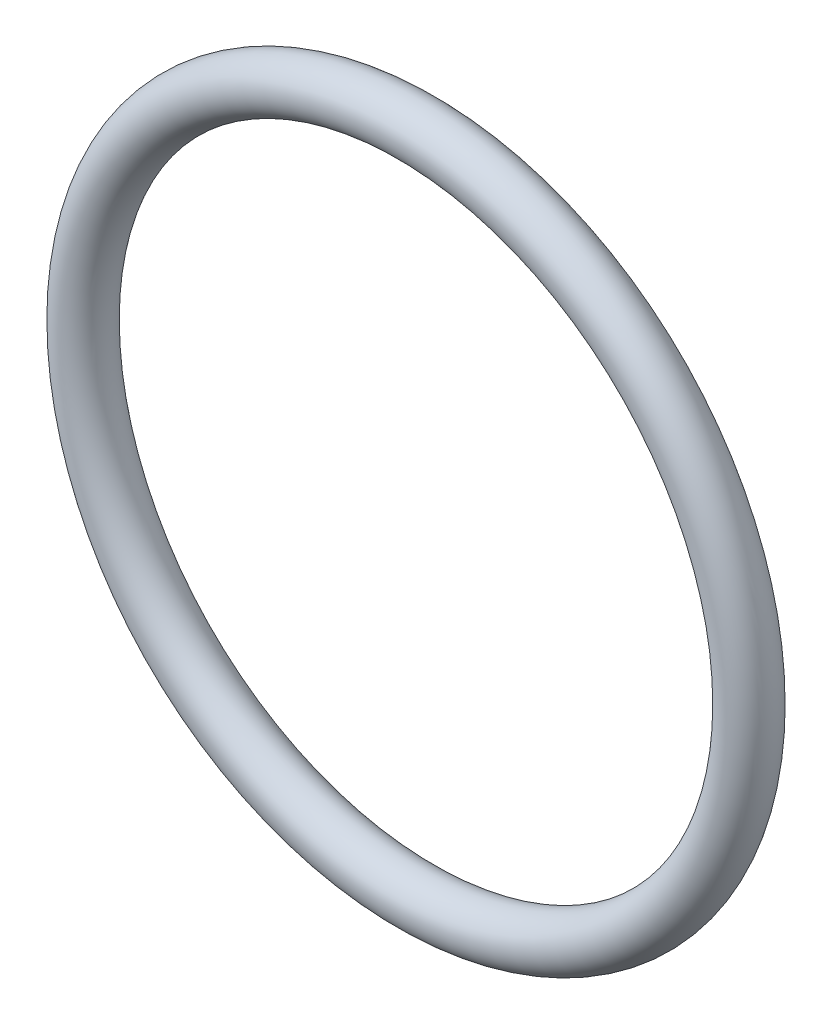
ISO-10303-21;
HEADER;
FILE_DESCRIPTION(('STEP AP214'),'2;1');
FILE_NAME('part.step','',(''),(''),'','','');
FILE_SCHEMA(('AUTOMOTIVE_DESIGN { 1 0 10303 214 1 1 1 1 }'));
ENDSEC;
DATA;
#1=APPLICATION_CONTEXT('core data for automotive mechanical design processes');
#2=APPLICATION_PROTOCOL_DEFINITION('international standard','automotive_design',2000,#1);
#3=PRODUCT_CONTEXT('',#1,'mechanical');
#4=PRODUCT('Part','Part','',(#3));
#5=PRODUCT_RELATED_PRODUCT_CATEGORY('part','',(#4));
#6=PRODUCT_DEFINITION_FORMATION('','',#4);
#7=PRODUCT_DEFINITION_CONTEXT('part definition',#1,'design');
#8=PRODUCT_DEFINITION('design','',#6,#7);
#9=PRODUCT_DEFINITION_SHAPE('','',#8);
#10=(LENGTH_UNIT() NAMED_UNIT(*) SI_UNIT(.MILLI.,.METRE.));
#11=(NAMED_UNIT(*) PLANE_ANGLE_UNIT() SI_UNIT($,.RADIAN.));
#12=(NAMED_UNIT(*) SI_UNIT($,.STERADIAN.) SOLID_ANGLE_UNIT());
#13=UNCERTAINTY_MEASURE_WITH_UNIT(LENGTH_MEASURE(1.E-05),#10,'distance_accuracy_value','');
#14=(GEOMETRIC_REPRESENTATION_CONTEXT(3) GLOBAL_UNCERTAINTY_ASSIGNED_CONTEXT((#13)) GLOBAL_UNIT_ASSIGNED_CONTEXT((#10,
#11,#12)) REPRESENTATION_CONTEXT('',''));
#15=CARTESIAN_POINT('',(0.,0.,0.));
#16=DIRECTION('',(0.,0.,1.));
#17=DIRECTION('',(1.,0.,0.));
#18=AXIS2_PLACEMENT_3D('',#15,#16,#17);
#19=CARTESIAN_POINT('',(0.,0.,0.));
#20=DIRECTION('',(0.,0.,-1.));
#21=DIRECTION('',(-1.,0.,0.));
#22=AXIS2_PLACEMENT_3D('',#19,#20,#21);
#23=TOROIDAL_SURFACE('',#22,16.25,1.25);
#24=CARTESIAN_POINT('',(-17.5,0.,0.));
#25=VERTEX_POINT('',#24);
#26=VERTEX_LOOP('',#25);
#27=FACE_BOUND('',#26,.T.);
#28=ADVANCED_FACE('F29',(#27),#23,.T.);
#29=CLOSED_SHELL('',(#28));
#30=MANIFOLD_SOLID_BREP('B2',#29);
#31=ADVANCED_BREP_SHAPE_REPRESENTATION('',(#18,#30),#14);
#32=SHAPE_DEFINITION_REPRESENTATION(#9,#31);
ENDSEC;
END-ISO-10303-21;
